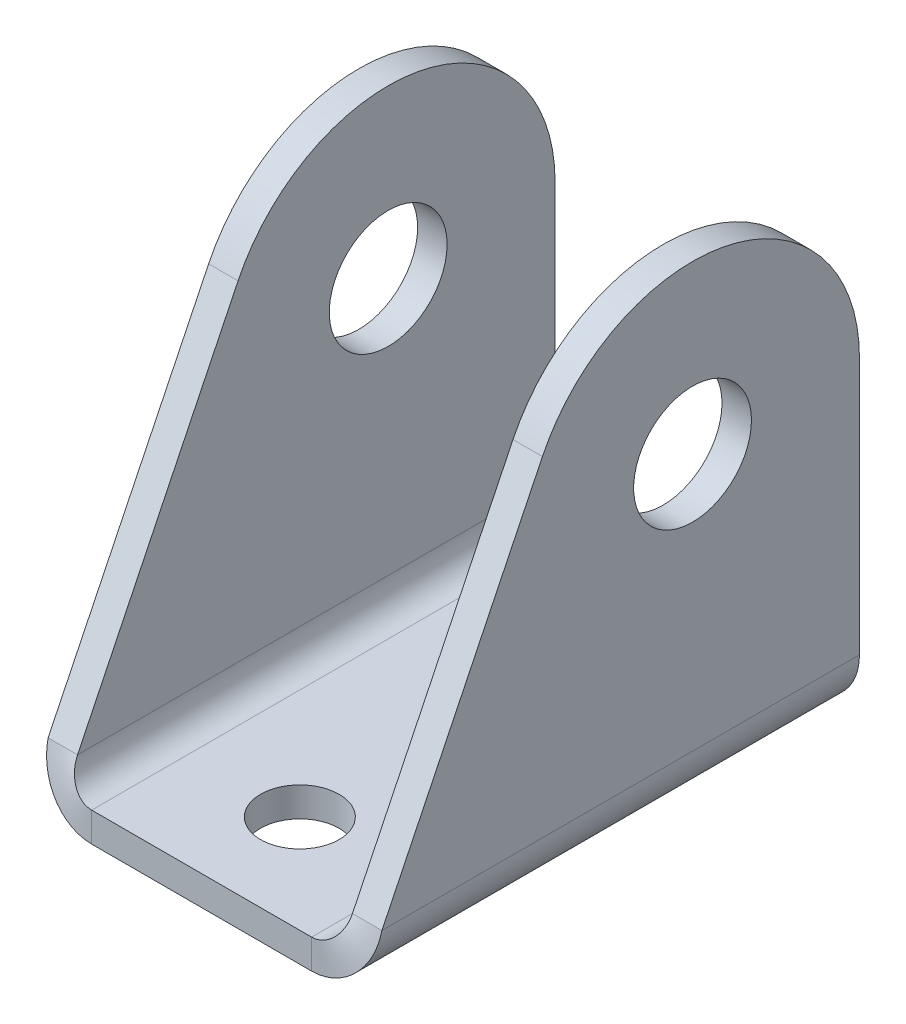
ISO-10303-21;
HEADER;
FILE_DESCRIPTION(('STEP AP214'),'2;1');
FILE_NAME('part.step','',(''),(''),'','','');
FILE_SCHEMA(('AUTOMOTIVE_DESIGN { 1 0 10303 214 1 1 1 1 }'));
ENDSEC;
DATA;
#1=APPLICATION_CONTEXT('core data for automotive mechanical design processes');
#2=APPLICATION_PROTOCOL_DEFINITION('international standard','automotive_design',2000,#1);
#3=PRODUCT_CONTEXT('',#1,'mechanical');
#4=PRODUCT('Part','Part','',(#3));
#5=PRODUCT_RELATED_PRODUCT_CATEGORY('part','',(#4));
#6=PRODUCT_DEFINITION_FORMATION('','',#4);
#7=PRODUCT_DEFINITION_CONTEXT('part definition',#1,'design');
#8=PRODUCT_DEFINITION('design','',#6,#7);
#9=PRODUCT_DEFINITION_SHAPE('','',#8);
#10=(LENGTH_UNIT() NAMED_UNIT(*) SI_UNIT(.MILLI.,.METRE.));
#11=(NAMED_UNIT(*) PLANE_ANGLE_UNIT() SI_UNIT($,.RADIAN.));
#12=(NAMED_UNIT(*) SI_UNIT($,.STERADIAN.) SOLID_ANGLE_UNIT());
#13=UNCERTAINTY_MEASURE_WITH_UNIT(LENGTH_MEASURE(1.E-05),#10,'distance_accuracy_value','');
#14=(GEOMETRIC_REPRESENTATION_CONTEXT(3) GLOBAL_UNCERTAINTY_ASSIGNED_CONTEXT((#13)) GLOBAL_UNIT_ASSIGNED_CONTEXT((#10,
#11,#12)) REPRESENTATION_CONTEXT('',''));
#15=CARTESIAN_POINT('',(0.,0.,0.));
#16=DIRECTION('',(0.,0.,1.));
#17=DIRECTION('',(1.,0.,0.));
#18=AXIS2_PLACEMENT_3D('',#15,#16,#17);
#19=CARTESIAN_POINT('',(17.,3.,-25.));
#20=DIRECTION('',(0.,0.,1.));
#21=DIRECTION('',(-1.,0.,0.));
#22=AXIS2_PLACEMENT_3D('',#19,#20,#21);
#23=PLANE('',#22);
#24=DIRECTION('',(0.,1.,0.));
#25=VECTOR('',#24,1.);
#26=CARTESIAN_POINT('',(11.2,3.,-25.));
#27=LINE('',#26,#25);
#28=CARTESIAN_POINT('',(11.2,0.,-25.));
#29=VERTEX_POINT('',#28);
#30=CARTESIAN_POINT('',(11.2,3.,-25.));
#31=VERTEX_POINT('',#30);
#32=EDGE_CURVE('E11',#29,#31,#27,.T.);
#33=ORIENTED_EDGE('',*,*,#32,.F.);
#34=DIRECTION('',(1.,0.,0.));
#35=VECTOR('',#34,1.);
#36=CARTESIAN_POINT('',(0.,0.,-25.));
#37=LINE('',#36,#35);
#38=CARTESIAN_POINT('',(-11.2,0.,-25.));
#39=VERTEX_POINT('',#38);
#40=EDGE_CURVE('E96',#29,#39,#37,.F.);
#41=ORIENTED_EDGE('',*,*,#40,.T.);
#42=DIRECTION('',(0.,1.,0.));
#43=VECTOR('',#42,1.);
#44=CARTESIAN_POINT('',(-11.2,3.,-25.));
#45=LINE('',#44,#43);
#46=CARTESIAN_POINT('',(-11.2,3.,-25.));
#47=VERTEX_POINT('',#46);
#48=EDGE_CURVE('E49',#39,#47,#45,.T.);
#49=ORIENTED_EDGE('',*,*,#48,.T.);
#50=DIRECTION('',(-1.,0.,0.));
#51=VECTOR('',#50,1.);
#52=CARTESIAN_POINT('',(17.,3.,-25.));
#53=LINE('',#52,#51);
#54=EDGE_CURVE('E98',#31,#47,#53,.T.);
#55=ORIENTED_EDGE('',*,*,#54,.F.);
#56=EDGE_LOOP('',(#33,#41,#49,#55));
#57=FACE_BOUND('',#56,.T.);
#58=ADVANCED_FACE('F39',(#57),#23,.F.);
#59=CARTESIAN_POINT('',(-11.2,5.8,-25.));
#60=DIRECTION('',(0.,0.,-1.));
#61=DIRECTION('',(-1.,0.,0.));
#62=AXIS2_PLACEMENT_3D('',#59,#60,#61);
#63=PLANE('',#62);
#64=ORIENTED_EDGE('',*,*,#48,.F.);
#65=CARTESIAN_POINT('',(-11.2,5.8,-25.));
#66=DIRECTION('',(0.,0.,1.));
#67=DIRECTION('',(1.,0.,0.));
#68=AXIS2_PLACEMENT_3D('',#65,#66,#67);
#69=CIRCLE('',#68,5.8);
#70=CARTESIAN_POINT('',(-17.,5.8,-25.));
#71=VERTEX_POINT('',#70);
#72=EDGE_CURVE('E182',#39,#71,#69,.F.);
#73=ORIENTED_EDGE('',*,*,#72,.T.);
#74=DIRECTION('',(1.,0.,0.));
#75=VECTOR('',#74,1.);
#76=CARTESIAN_POINT('',(-14.,5.8,-25.));
#77=LINE('',#76,#75);
#78=CARTESIAN_POINT('',(-14.,5.8,-25.));
#79=VERTEX_POINT('',#78);
#80=EDGE_CURVE('E172',#71,#79,#77,.T.);
#81=ORIENTED_EDGE('',*,*,#80,.T.);
#82=CARTESIAN_POINT('',(-11.2,5.8,-25.));
#83=DIRECTION('',(0.,0.,1.));
#84=DIRECTION('',(1.,0.,0.));
#85=AXIS2_PLACEMENT_3D('',#82,#83,#84);
#86=CIRCLE('',#85,2.8);
#87=EDGE_CURVE('E180',#47,#79,#86,.F.);
#88=ORIENTED_EDGE('',*,*,#87,.F.);
#89=EDGE_LOOP('',(#64,#73,#81,#88));
#90=FACE_BOUND('',#89,.T.);
#91=ADVANCED_FACE('F179',(#90),#63,.T.);
#92=CARTESIAN_POINT('',(-14.,32.,-25.));
#93=DIRECTION('',(0.,0.,1.));
#94=DIRECTION('',(0.,1.,0.));
#95=AXIS2_PLACEMENT_3D('',#92,#93,#94);
#96=PLANE('',#95);
#97=ORIENTED_EDGE('',*,*,#80,.F.);
#98=DIRECTION('',(0.,-1.,0.));
#99=VECTOR('',#98,1.);
#100=CARTESIAN_POINT('',(-17.,32.,-25.));
#101=LINE('',#100,#99);
#102=CARTESIAN_POINT('',(-17.,32.,-25.));
#103=VERTEX_POINT('',#102);
#104=EDGE_CURVE('E241',#71,#103,#101,.F.);
#105=ORIENTED_EDGE('',*,*,#104,.T.);
#106=DIRECTION('',(1.,0.,0.));
#107=VECTOR('',#106,1.);
#108=CARTESIAN_POINT('',(-14.,32.,-25.));
#109=LINE('',#108,#107);
#110=CARTESIAN_POINT('',(-14.,32.,-25.));
#111=VERTEX_POINT('',#110);
#112=EDGE_CURVE('E169',#103,#111,#109,.T.);
#113=ORIENTED_EDGE('',*,*,#112,.T.);
#114=DIRECTION('',(0.,1.,0.));
#115=VECTOR('',#114,1.);
#116=CARTESIAN_POINT('',(-14.,32.,-25.));
#117=LINE('',#116,#115);
#118=EDGE_CURVE('E199',#79,#111,#117,.T.);
#119=ORIENTED_EDGE('',*,*,#118,.F.);
#120=EDGE_LOOP('',(#97,#105,#113,#119));
#121=FACE_BOUND('',#120,.T.);
#122=ADVANCED_FACE('F200',(#121),#96,.F.);
#123=CARTESIAN_POINT('',(-14.,32.,-8.));
#124=DIRECTION('',(-1.,0.,0.));
#125=DIRECTION('',(0.,0.,1.));
#126=AXIS2_PLACEMENT_3D('',#123,#124,#125);
#127=CYLINDRICAL_SURFACE('',#126,17.);
#128=ORIENTED_EDGE('',*,*,#112,.F.);
#129=CARTESIAN_POINT('',(-17.,32.,-8.));
#130=DIRECTION('',(1.,0.,0.));
#131=DIRECTION('',(0.,0.,-1.));
#132=AXIS2_PLACEMENT_3D('',#129,#130,#131);
#133=CIRCLE('',#132,17.);
#134=CARTESIAN_POINT('',(-17.,39.4324838605148,7.28915248348275));
#135=VERTEX_POINT('',#134);
#136=EDGE_CURVE('E146',#103,#135,#133,.T.);
#137=ORIENTED_EDGE('',*,*,#136,.T.);
#138=DIRECTION('',(1.,0.,0.));
#139=VECTOR('',#138,1.);
#140=CARTESIAN_POINT('',(-14.,39.4324838605148,7.28915248348275));
#141=LINE('',#140,#139);
#142=CARTESIAN_POINT('',(-14.,39.4324838605148,7.28915248348275));
#143=VERTEX_POINT('',#142);
#144=EDGE_CURVE('E166',#135,#143,#141,.T.);
#145=ORIENTED_EDGE('',*,*,#144,.T.);
#146=CARTESIAN_POINT('',(-14.,32.,-8.));
#147=DIRECTION('',(1.,0.,0.));
#148=DIRECTION('',(0.,0.,-1.));
#149=AXIS2_PLACEMENT_3D('',#146,#147,#148);
#150=CIRCLE('',#149,17.);
#151=EDGE_CURVE('E204',#111,#143,#150,.T.);
#152=ORIENTED_EDGE('',*,*,#151,.F.);
#153=EDGE_LOOP('',(#128,#137,#145,#152));
#154=FACE_BOUND('',#153,.T.);
#155=ADVANCED_FACE('F252',(#154),#127,.T.);
#156=CARTESIAN_POINT('',(-14.,3.,25.));
#157=DIRECTION('',(0.,-0.437204932971461,-0.899361910793102));
#158=DIRECTION('',(0.,-0.899361910793102,0.437204932971461));
#159=AXIS2_PLACEMENT_3D('',#156,#157,#158);
#160=PLANE('',#159);
#161=ORIENTED_EDGE('',*,*,#144,.F.);
#162=DIRECTION('',(0.,-0.899361910793102,0.437204932971461));
#163=VECTOR('',#162,1.);
#164=CARTESIAN_POINT('',(-17.,3.,25.));
#165=LINE('',#164,#163);
#166=CARTESIAN_POINT('',(-17.,5.8,23.6388418303811));
#167=VERTEX_POINT('',#166);
#168=EDGE_CURVE('E136',#135,#167,#165,.T.);
#169=ORIENTED_EDGE('',*,*,#168,.T.);
#170=DIRECTION('',(1.,0.,0.));
#171=VECTOR('',#170,1.);
#172=CARTESIAN_POINT('',(-14.,5.8,23.6388418303811));
#173=LINE('',#172,#171);
#174=CARTESIAN_POINT('',(-14.,5.8,23.6388418303811));
#175=VERTEX_POINT('',#174);
#176=EDGE_CURVE('E163',#167,#175,#173,.T.);
#177=ORIENTED_EDGE('',*,*,#176,.T.);
#178=DIRECTION('',(0.,-0.899361910793102,0.437204932971461));
#179=VECTOR('',#178,1.);
#180=CARTESIAN_POINT('',(-14.,3.,25.));
#181=LINE('',#180,#179);
#182=EDGE_CURVE('E205',#143,#175,#181,.T.);
#183=ORIENTED_EDGE('',*,*,#182,.F.);
#184=EDGE_LOOP('',(#161,#169,#177,#183));
#185=FACE_BOUND('',#184,.T.);
#186=ADVANCED_FACE('F385',(#185),#160,.F.);
#187=CARTESIAN_POINT('',(-11.2,0.,25.));
#188=CARTESIAN_POINT('',(-11.2,1.,25.));
#189=CARTESIAN_POINT('',(-11.2,2.,25.));
#190=CARTESIAN_POINT('',(-11.2,3.,25.));
#191=CARTESIAN_POINT('',(0.399999999999982,0.,25.));
#192=CARTESIAN_POINT('',(-1.60000000000002,0.999999999999989,25.));
#193=CARTESIAN_POINT('',(-3.60000000000001,1.99999999999999,25.));
#194=CARTESIAN_POINT('',(-5.60000000000001,2.99999999999999,25.));
#195=CARTESIAN_POINT('',(0.399999999999996,11.6,22.2776836607622));
#196=CARTESIAN_POINT('',(-1.6,10.6,22.2776836607622));
#197=CARTESIAN_POINT('',(-3.6,9.59999999999999,22.2776836607622));
#198=CARTESIAN_POINT('',(-5.6,8.59999999999999,22.2776836607622));
#199=CARTESIAN_POINT('',(-11.2,11.6,22.2776836607622));
#200=CARTESIAN_POINT('',(-11.2,10.6,22.2776836607622));
#201=CARTESIAN_POINT('',(-11.2,9.6,22.2776836607622));
#202=CARTESIAN_POINT('',(-11.2,8.6,22.2776836607622));
#203=CARTESIAN_POINT('',(-22.8,11.6,22.2776836607622));
#204=CARTESIAN_POINT('',(-20.8,10.6,22.2776836607622));
#205=CARTESIAN_POINT('',(-18.8,9.60000000000001,22.2776836607622));
#206=CARTESIAN_POINT('',(-16.8,8.6,22.2776836607622));
#207=CARTESIAN_POINT('',(-22.8,0.,25.));
#208=CARTESIAN_POINT('',(-20.8,1.00000000000001,25.));
#209=CARTESIAN_POINT('',(-18.8,2.00000000000001,25.));
#210=CARTESIAN_POINT('',(-16.8,3.00000000000001,25.));
#211=CARTESIAN_POINT('',(-11.2,0.,25.));
#212=CARTESIAN_POINT('',(-11.2,1.,25.));
#213=CARTESIAN_POINT('',(-11.2,2.,25.));
#214=CARTESIAN_POINT('',(-11.2,3.,25.));
#215=(BOUNDED_SURFACE() B_SPLINE_SURFACE(3,3,((#187,#188,#189,#190),(#191,#192,#193,#194),(#195,
#196,#197,#198),(#199,#200,#201,#202),(#203,#204,#205,#206),(#207,#208,#209,#210),(#211,#212,
#213,#214)),.UNSPECIFIED.,.T.,.F.,.F.) B_SPLINE_SURFACE_WITH_KNOTS((4,3,4),(4,4),(0.,0.5,1.),
(0.,1.),.UNSPECIFIED.) GEOMETRIC_REPRESENTATION_ITEM() RATIONAL_B_SPLINE_SURFACE(((1.,1.,1.,1.),
(0.333333333333333,0.333333333333333,0.333333333333333,0.333333333333333),(0.333333333333333,
0.333333333333333,0.333333333333333,0.333333333333333),(1.,1.,1.,1.),(0.333333333333333,
0.333333333333333,0.333333333333333,0.333333333333333),(0.333333333333333,0.333333333333333,
0.333333333333333,0.333333333333333),(1.,1.,1.,1.))) REPRESENTATION_ITEM('') SURFACE());
#216=CARTESIAN_POINT('',(-11.2,5.8,23.6388418303811));
#217=DIRECTION('',(0.,-0.22847503868709,-0.973549771042515));
#218=DIRECTION('',(0.,-0.973549771042515,0.22847503868709));
#219=AXIS2_PLACEMENT_3D('',#216,#217,#218);
#220=ELLIPSE('',#219,5.95757933750951,5.8);
#221=CARTESIAN_POINT('',(-11.2,0.,25.));
#222=VERTEX_POINT('',#221);
#223=EDGE_CURVE('E138',#167,#222,#220,.F.);
#224=DIRECTION('',(0.,1.,0.));
#225=VECTOR('',#224,1.);
#226=CARTESIAN_POINT('',(-11.2,3.,25.));
#227=LINE('',#226,#225);
#228=CARTESIAN_POINT('',(-11.2,3.,25.));
#229=VERTEX_POINT('',#228);
#230=EDGE_CURVE('E161',#222,#229,#227,.T.);
#231=CARTESIAN_POINT('',(-11.2,5.8,23.6388418303811));
#232=DIRECTION('',(0.,-0.437204932971461,-0.899361910793102));
#233=DIRECTION('',(0.,-0.899361910793102,0.437204932971461));
#234=AXIS2_PLACEMENT_3D('',#231,#232,#233);
#235=ELLIPSE('',#234,3.11331841653247,2.8);
#236=EDGE_CURVE('E196',#175,#229,#235,.F.);
#237=ORIENTED_EDGE('',*,*,#176,.F.);
#238=ORIENTED_EDGE('',*,*,#223,.T.);
#239=ORIENTED_EDGE('',*,*,#230,.T.);
#240=ORIENTED_EDGE('',*,*,#236,.F.);
#241=EDGE_LOOP('',(#237,#238,#239,#240));
#242=FACE_BOUND('',#241,.T.);
#243=ADVANCED_FACE('F379',(#242),#215,.T.);
#244=CARTESIAN_POINT('',(17.,3.,25.));
#245=DIRECTION('',(0.,0.,-1.));
#246=DIRECTION('',(1.,0.,0.));
#247=AXIS2_PLACEMENT_3D('',#244,#245,#246);
#248=PLANE('',#247);
#249=ORIENTED_EDGE('',*,*,#230,.F.);
#250=DIRECTION('',(1.,0.,0.));
#251=VECTOR('',#250,1.);
#252=CARTESIAN_POINT('',(0.,0.,25.));
#253=LINE('',#252,#251);
#254=CARTESIAN_POINT('',(11.2,0.,25.));
#255=VERTEX_POINT('',#254);
#256=EDGE_CURVE('E127',#222,#255,#253,.T.);
#257=ORIENTED_EDGE('',*,*,#256,.T.);
#258=DIRECTION('',(0.,1.,0.));
#259=VECTOR('',#258,1.);
#260=CARTESIAN_POINT('',(11.2,3.,25.));
#261=LINE('',#260,#259);
#262=CARTESIAN_POINT('',(11.2,3.,25.));
#263=VERTEX_POINT('',#262);
#264=EDGE_CURVE('E158',#255,#263,#261,.T.);
#265=ORIENTED_EDGE('',*,*,#264,.T.);
#266=DIRECTION('',(1.,0.,0.));
#267=VECTOR('',#266,1.);
#268=CARTESIAN_POINT('',(17.,3.,25.));
#269=LINE('',#268,#267);
#270=EDGE_CURVE('E264',#229,#263,#269,.T.);
#271=ORIENTED_EDGE('',*,*,#270,.F.);
#272=EDGE_LOOP('',(#249,#257,#265,#271));
#273=FACE_BOUND('',#272,.T.);
#274=ADVANCED_FACE('F370',(#273),#248,.F.);
#275=CARTESIAN_POINT('',(11.2,8.6,22.2776836607622));
#276=CARTESIAN_POINT('',(11.2,9.6,22.2776836607622));
#277=CARTESIAN_POINT('',(11.2,10.6,22.2776836607622));
#278=CARTESIAN_POINT('',(11.2,11.6,22.2776836607622));
#279=CARTESIAN_POINT('',(5.60000000000001,8.6,22.2776836607622));
#280=CARTESIAN_POINT('',(3.60000000000001,9.6,22.2776836607622));
#281=CARTESIAN_POINT('',(1.60000000000001,10.6,22.2776836607622));
#282=CARTESIAN_POINT('',(-0.399999999999989,11.6,22.2776836607622));
#283=CARTESIAN_POINT('',(5.60000000000001,3.,25.));
#284=CARTESIAN_POINT('',(3.60000000000001,2.,25.));
#285=CARTESIAN_POINT('',(1.60000000000001,1.,25.));
#286=CARTESIAN_POINT('',(-0.399999999999989,0.,25.));
#287=CARTESIAN_POINT('',(11.2,3.,25.));
#288=CARTESIAN_POINT('',(11.2,2.,25.));
#289=CARTESIAN_POINT('',(11.2,1.,25.));
#290=CARTESIAN_POINT('',(11.2,0.,25.));
#291=CARTESIAN_POINT('',(16.8,3.,25.));
#292=CARTESIAN_POINT('',(18.8,2.,25.));
#293=CARTESIAN_POINT('',(20.8,0.999999999999999,25.));
#294=CARTESIAN_POINT('',(22.8,0.,25.));
#295=CARTESIAN_POINT('',(16.8,8.6,22.2776836607622));
#296=CARTESIAN_POINT('',(18.8,9.6,22.2776836607622));
#297=CARTESIAN_POINT('',(20.8,10.6,22.2776836607622));
#298=CARTESIAN_POINT('',(22.8,11.6,22.2776836607622));
#299=CARTESIAN_POINT('',(11.2,8.6,22.2776836607622));
#300=CARTESIAN_POINT('',(11.2,9.6,22.2776836607622));
#301=CARTESIAN_POINT('',(11.2,10.6,22.2776836607622));
#302=CARTESIAN_POINT('',(11.2,11.6,22.2776836607622));
#303=(BOUNDED_SURFACE() B_SPLINE_SURFACE(3,3,((#275,#276,#277,#278),(#279,#280,#281,#282),(#283,
#284,#285,#286),(#287,#288,#289,#290),(#291,#292,#293,#294),(#295,#296,#297,#298),(#299,#300,
#301,#302)),.UNSPECIFIED.,.T.,.F.,.F.) B_SPLINE_SURFACE_WITH_KNOTS((4,3,4),(4,4),(0.,0.5,1.),
(0.,1.),.UNSPECIFIED.) GEOMETRIC_REPRESENTATION_ITEM() RATIONAL_B_SPLINE_SURFACE(((1.,1.,1.,1.),
(0.333333333333333,0.333333333333333,0.333333333333333,0.333333333333333),(0.333333333333333,
0.333333333333333,0.333333333333333,0.333333333333333),(1.,1.,1.,1.),(0.333333333333333,
0.333333333333333,0.333333333333333,0.333333333333333),(0.333333333333333,0.333333333333333,
0.333333333333333,0.333333333333333),(1.,1.,1.,1.))) REPRESENTATION_ITEM('') SURFACE());
#304=CARTESIAN_POINT('',(11.2,5.8,23.6388418303811));
#305=DIRECTION('',(0.,0.22847503868709,0.973549771042515));
#306=DIRECTION('',(0.,0.973549771042515,-0.22847503868709));
#307=AXIS2_PLACEMENT_3D('',#304,#305,#306);
#308=ELLIPSE('',#307,5.95757933750951,5.8);
#309=CARTESIAN_POINT('',(17.,5.8,23.6388418303811));
#310=VERTEX_POINT('',#309);
#311=EDGE_CURVE('E114',#255,#310,#308,.T.);
#312=DIRECTION('',(-1.,0.,0.));
#313=VECTOR('',#312,1.);
#314=CARTESIAN_POINT('',(14.,5.8,23.6388418303811));
#315=LINE('',#314,#313);
#316=CARTESIAN_POINT('',(14.,5.8,23.6388418303811));
#317=VERTEX_POINT('',#316);
#318=EDGE_CURVE('E155',#310,#317,#315,.T.);
#319=CARTESIAN_POINT('',(11.2,5.8,23.6388418303811));
#320=DIRECTION('',(0.,0.437204932971461,0.899361910793102));
#321=DIRECTION('',(0.,0.899361910793102,-0.437204932971461));
#322=AXIS2_PLACEMENT_3D('',#319,#320,#321);
#323=ELLIPSE('',#322,3.11331841653247,2.8);
#324=EDGE_CURVE('E221',#263,#317,#323,.T.);
#325=ORIENTED_EDGE('',*,*,#264,.F.);
#326=ORIENTED_EDGE('',*,*,#311,.T.);
#327=ORIENTED_EDGE('',*,*,#318,.T.);
#328=ORIENTED_EDGE('',*,*,#324,.F.);
#329=EDGE_LOOP('',(#325,#326,#327,#328));
#330=FACE_BOUND('',#329,.T.);
#331=ADVANCED_FACE('F364',(#330),#303,.F.);
#332=CARTESIAN_POINT('',(14.,3.,25.));
#333=DIRECTION('',(0.,0.437204932971461,0.899361910793102));
#334=DIRECTION('',(0.,-0.899361910793102,0.437204932971461));
#335=AXIS2_PLACEMENT_3D('',#332,#333,#334);
#336=PLANE('',#335);
#337=ORIENTED_EDGE('',*,*,#318,.F.);
#338=DIRECTION('',(0.,-0.899361910793102,0.437204932971461));
#339=VECTOR('',#338,1.);
#340=CARTESIAN_POINT('',(17.,3.,25.));
#341=LINE('',#340,#339);
#342=CARTESIAN_POINT('',(17.,39.4324838605148,7.28915248348275));
#343=VERTEX_POINT('',#342);
#344=EDGE_CURVE('E231',#343,#310,#341,.T.);
#345=ORIENTED_EDGE('',*,*,#344,.F.);
#346=DIRECTION('',(-1.,0.,0.));
#347=VECTOR('',#346,1.);
#348=CARTESIAN_POINT('',(14.,39.4324838605148,7.28915248348275));
#349=LINE('',#348,#347);
#350=CARTESIAN_POINT('',(14.,39.4324838605148,7.28915248348275));
#351=VERTEX_POINT('',#350);
#352=EDGE_CURVE('E152',#343,#351,#349,.T.);
#353=ORIENTED_EDGE('',*,*,#352,.T.);
#354=DIRECTION('',(0.,-0.899361910793102,0.437204932971461));
#355=VECTOR('',#354,1.);
#356=CARTESIAN_POINT('',(14.,3.,25.));
#357=LINE('',#356,#355);
#358=EDGE_CURVE('E274',#351,#317,#357,.T.);
#359=ORIENTED_EDGE('',*,*,#358,.T.);
#360=EDGE_LOOP('',(#337,#345,#353,#359));
#361=FACE_BOUND('',#360,.T.);
#362=ADVANCED_FACE('F360',(#361),#336,.T.);
#363=CARTESIAN_POINT('',(14.,32.,-8.));
#364=DIRECTION('',(1.,0.,0.));
#365=DIRECTION('',(0.,0.,-1.));
#366=AXIS2_PLACEMENT_3D('',#363,#364,#365);
#367=CYLINDRICAL_SURFACE('',#366,17.);
#368=ORIENTED_EDGE('',*,*,#352,.F.);
#369=CARTESIAN_POINT('',(17.,32.,-8.));
#370=DIRECTION('',(1.,0.,0.));
#371=DIRECTION('',(0.,0.,-1.));
#372=AXIS2_PLACEMENT_3D('',#369,#370,#371);
#373=CIRCLE('',#372,17.);
#374=CARTESIAN_POINT('',(17.,32.,-25.));
#375=VERTEX_POINT('',#374);
#376=EDGE_CURVE('E222',#375,#343,#373,.T.);
#377=ORIENTED_EDGE('',*,*,#376,.F.);
#378=DIRECTION('',(-1.,0.,0.));
#379=VECTOR('',#378,1.);
#380=CARTESIAN_POINT('',(14.,32.,-25.));
#381=LINE('',#380,#379);
#382=CARTESIAN_POINT('',(14.,32.,-25.));
#383=VERTEX_POINT('',#382);
#384=EDGE_CURVE('E149',#375,#383,#381,.T.);
#385=ORIENTED_EDGE('',*,*,#384,.T.);
#386=CARTESIAN_POINT('',(14.,32.,-8.));
#387=DIRECTION('',(1.,0.,0.));
#388=DIRECTION('',(0.,0.,-1.));
#389=AXIS2_PLACEMENT_3D('',#386,#387,#388);
#390=CIRCLE('',#389,17.);
#391=EDGE_CURVE('E277',#383,#351,#390,.T.);
#392=ORIENTED_EDGE('',*,*,#391,.T.);
#393=EDGE_LOOP('',(#368,#377,#385,#392));
#394=FACE_BOUND('',#393,.T.);
#395=ADVANCED_FACE('F356',(#394),#367,.T.);
#396=CARTESIAN_POINT('',(14.,32.,-25.));
#397=DIRECTION('',(0.,0.,-1.));
#398=DIRECTION('',(0.,1.,0.));
#399=AXIS2_PLACEMENT_3D('',#396,#397,#398);
#400=PLANE('',#399);
#401=ORIENTED_EDGE('',*,*,#384,.F.);
#402=DIRECTION('',(0.,1.,0.));
#403=VECTOR('',#402,1.);
#404=CARTESIAN_POINT('',(17.,32.,-25.));
#405=LINE('',#404,#403);
#406=CARTESIAN_POINT('',(17.,5.8,-25.));
#407=VERTEX_POINT('',#406);
#408=EDGE_CURVE('E228',#407,#375,#405,.T.);
#409=ORIENTED_EDGE('',*,*,#408,.F.);
#410=DIRECTION('',(-1.,0.,0.));
#411=VECTOR('',#410,1.);
#412=CARTESIAN_POINT('',(14.,5.8,-25.));
#413=LINE('',#412,#411);
#414=CARTESIAN_POINT('',(14.,5.8,-25.));
#415=VERTEX_POINT('',#414);
#416=EDGE_CURVE('E43',#407,#415,#413,.T.);
#417=ORIENTED_EDGE('',*,*,#416,.T.);
#418=DIRECTION('',(0.,1.,0.));
#419=VECTOR('',#418,1.);
#420=CARTESIAN_POINT('',(14.,32.,-25.));
#421=LINE('',#420,#419);
#422=EDGE_CURVE('E271',#415,#383,#421,.T.);
#423=ORIENTED_EDGE('',*,*,#422,.T.);
#424=EDGE_LOOP('',(#401,#409,#417,#423));
#425=FACE_BOUND('',#424,.T.);
#426=ADVANCED_FACE('F353',(#425),#400,.T.);
#427=CARTESIAN_POINT('',(-14.,32.,-8.));
#428=DIRECTION('',(-1.,0.,0.));
#429=DIRECTION('',(0.,0.,1.));
#430=AXIS2_PLACEMENT_3D('',#427,#428,#429);
#431=CYLINDRICAL_SURFACE('',#430,6.);
#432=CARTESIAN_POINT('',(-14.,32.,-8.));
#433=DIRECTION('',(1.,0.,0.));
#434=DIRECTION('',(0.,0.,-1.));
#435=AXIS2_PLACEMENT_3D('',#432,#433,#434);
#436=CIRCLE('',#435,6.);
#437=CARTESIAN_POINT('',(-14.,32.,-14.));
#438=VERTEX_POINT('',#437);
#439=EDGE_CURVE('E287',#438,#438,#436,.T.);
#440=ORIENTED_EDGE('',*,*,#439,.T.);
#441=EDGE_LOOP('',(#440));
#442=FACE_BOUND('',#441,.T.);
#443=CARTESIAN_POINT('',(-17.,32.,-8.));
#444=DIRECTION('',(1.,0.,0.));
#445=DIRECTION('',(0.,0.,-1.));
#446=AXIS2_PLACEMENT_3D('',#443,#444,#445);
#447=CIRCLE('',#446,6.);
#448=CARTESIAN_POINT('',(-17.,32.,-14.));
#449=VERTEX_POINT('',#448);
#450=EDGE_CURVE('E133',#449,#449,#447,.T.);
#451=ORIENTED_EDGE('',*,*,#450,.F.);
#452=EDGE_LOOP('',(#451));
#453=FACE_BOUND('',#452,.T.);
#454=ADVANCED_FACE('F41',(#442,#453),#431,.F.);
#455=CARTESIAN_POINT('',(0.,3.,15.));
#456=DIRECTION('',(0.,-1.,0.));
#457=DIRECTION('',(0.,0.,-1.));
#458=AXIS2_PLACEMENT_3D('',#455,#456,#457);
#459=CYLINDRICAL_SURFACE('',#458,4.);
#460=CARTESIAN_POINT('',(0.,3.,15.));
#461=DIRECTION('',(0.,-1.,0.));
#462=DIRECTION('',(0.,0.,-1.));
#463=AXIS2_PLACEMENT_3D('',#460,#461,#462);
#464=CIRCLE('',#463,4.);
#465=CARTESIAN_POINT('',(0.,3.,11.));
#466=VERTEX_POINT('',#465);
#467=EDGE_CURVE('E255',#466,#466,#464,.T.);
#468=ORIENTED_EDGE('',*,*,#467,.F.);
#469=EDGE_LOOP('',(#468));
#470=FACE_BOUND('',#469,.T.);
#471=CARTESIAN_POINT('',(0.,0.,15.));
#472=DIRECTION('',(0.,-1.,0.));
#473=DIRECTION('',(0.,0.,-1.));
#474=AXIS2_PLACEMENT_3D('',#471,#472,#473);
#475=CIRCLE('',#474,4.);
#476=CARTESIAN_POINT('',(0.,0.,11.));
#477=VERTEX_POINT('',#476);
#478=EDGE_CURVE('E142',#477,#477,#475,.T.);
#479=ORIENTED_EDGE('',*,*,#478,.T.);
#480=EDGE_LOOP('',(#479));
#481=FACE_BOUND('',#480,.T.);
#482=ADVANCED_FACE('F317',(#470,#481),#459,.F.);
#483=CARTESIAN_POINT('',(0.,3.,-15.));
#484=DIRECTION('',(0.,-1.,0.));
#485=DIRECTION('',(0.,0.,-1.));
#486=AXIS2_PLACEMENT_3D('',#483,#484,#485);
#487=CYLINDRICAL_SURFACE('',#486,4.);
#488=CARTESIAN_POINT('',(0.,3.,-15.));
#489=DIRECTION('',(0.,1.,0.));
#490=DIRECTION('',(0.,0.,1.));
#491=AXIS2_PLACEMENT_3D('',#488,#489,#490);
#492=CIRCLE('',#491,4.);
#493=CARTESIAN_POINT('',(0.,3.,-11.));
#494=VERTEX_POINT('',#493);
#495=EDGE_CURVE('E258',#494,#494,#492,.T.);
#496=ORIENTED_EDGE('',*,*,#495,.T.);
#497=EDGE_LOOP('',(#496));
#498=FACE_BOUND('',#497,.T.);
#499=CARTESIAN_POINT('',(0.,0.,-15.));
#500=DIRECTION('',(0.,1.,0.));
#501=DIRECTION('',(0.,0.,1.));
#502=AXIS2_PLACEMENT_3D('',#499,#500,#501);
#503=CIRCLE('',#502,4.);
#504=CARTESIAN_POINT('',(0.,0.,-11.));
#505=VERTEX_POINT('',#504);
#506=EDGE_CURVE('E145',#505,#505,#503,.T.);
#507=ORIENTED_EDGE('',*,*,#506,.F.);
#508=EDGE_LOOP('',(#507));
#509=FACE_BOUND('',#508,.T.);
#510=ADVANCED_FACE('F319',(#498,#509),#487,.F.);
#511=CARTESIAN_POINT('',(14.,32.,-8.));
#512=DIRECTION('',(1.,0.,0.));
#513=DIRECTION('',(0.,0.,-1.));
#514=AXIS2_PLACEMENT_3D('',#511,#512,#513);
#515=CYLINDRICAL_SURFACE('',#514,6.);
#516=CARTESIAN_POINT('',(14.,32.,-8.));
#517=DIRECTION('',(1.,0.,0.));
#518=DIRECTION('',(0.,0.,-1.));
#519=AXIS2_PLACEMENT_3D('',#516,#517,#518);
#520=CIRCLE('',#519,6.);
#521=CARTESIAN_POINT('',(14.,32.,-14.));
#522=VERTEX_POINT('',#521);
#523=EDGE_CURVE('E268',#522,#522,#520,.T.);
#524=ORIENTED_EDGE('',*,*,#523,.F.);
#525=EDGE_LOOP('',(#524));
#526=FACE_BOUND('',#525,.T.);
#527=CARTESIAN_POINT('',(17.,32.,-8.));
#528=DIRECTION('',(1.,0.,0.));
#529=DIRECTION('',(0.,0.,-1.));
#530=AXIS2_PLACEMENT_3D('',#527,#528,#529);
#531=CIRCLE('',#530,6.);
#532=CARTESIAN_POINT('',(17.,32.,-14.));
#533=VERTEX_POINT('',#532);
#534=EDGE_CURVE('E126',#533,#533,#531,.T.);
#535=ORIENTED_EDGE('',*,*,#534,.T.);
#536=EDGE_LOOP('',(#535));
#537=FACE_BOUND('',#536,.T.);
#538=ADVANCED_FACE('F316',(#526,#537),#515,.F.);
#539=CARTESIAN_POINT('',(11.2,5.8,-25.));
#540=DIRECTION('',(0.,0.,1.));
#541=DIRECTION('',(1.,0.,0.));
#542=AXIS2_PLACEMENT_3D('',#539,#540,#541);
#543=PLANE('',#542);
#544=CARTESIAN_POINT('',(11.2,5.8,-25.));
#545=DIRECTION('',(0.,0.,-1.));
#546=DIRECTION('',(-1.,0.,0.));
#547=AXIS2_PLACEMENT_3D('',#544,#545,#546);
#548=CIRCLE('',#547,5.8);
#549=EDGE_CURVE('E111',#407,#29,#548,.T.);
#550=ORIENTED_EDGE('',*,*,#549,.T.);
#551=ORIENTED_EDGE('',*,*,#32,.T.);
#552=CARTESIAN_POINT('',(11.2,5.8,-25.));
#553=DIRECTION('',(0.,0.,-1.));
#554=DIRECTION('',(-1.,0.,0.));
#555=AXIS2_PLACEMENT_3D('',#552,#553,#554);
#556=CIRCLE('',#555,2.8);
#557=EDGE_CURVE('E217',#415,#31,#556,.T.);
#558=ORIENTED_EDGE('',*,*,#557,.F.);
#559=ORIENTED_EDGE('',*,*,#416,.F.);
#560=EDGE_LOOP('',(#550,#551,#558,#559));
#561=FACE_BOUND('',#560,.T.);
#562=ADVANCED_FACE('F130',(#561),#543,.F.);
#563=CARTESIAN_POINT('',(14.,32.,-8.));
#564=DIRECTION('',(1.,0.,0.));
#565=DIRECTION('',(0.,0.,-1.));
#566=AXIS2_PLACEMENT_3D('',#563,#564,#565);
#567=PLANE('',#566);
#568=ORIENTED_EDGE('',*,*,#523,.T.);
#569=EDGE_LOOP('',(#568));
#570=FACE_BOUND('',#569,.T.);
#571=ORIENTED_EDGE('',*,*,#422,.F.);
#572=DIRECTION('',(0.,0.,1.));
#573=VECTOR('',#572,1.);
#574=CARTESIAN_POINT('',(14.,5.8,25.));
#575=LINE('',#574,#573);
#576=EDGE_CURVE('E214',#415,#317,#575,.T.);
#577=ORIENTED_EDGE('',*,*,#576,.T.);
#578=ORIENTED_EDGE('',*,*,#358,.F.);
#579=ORIENTED_EDGE('',*,*,#391,.F.);
#580=EDGE_LOOP('',(#571,#577,#578,#579));
#581=FACE_BOUND('',#580,.T.);
#582=ADVANCED_FACE('F303',(#570,#581),#567,.F.);
#583=CARTESIAN_POINT('',(0.,3.,0.));
#584=DIRECTION('',(0.,-1.,0.));
#585=DIRECTION('',(0.,0.,-1.));
#586=AXIS2_PLACEMENT_3D('',#583,#584,#585);
#587=PLANE('',#586);
#588=ORIENTED_EDGE('',*,*,#467,.T.);
#589=EDGE_LOOP('',(#588));
#590=FACE_BOUND('',#589,.T.);
#591=ORIENTED_EDGE('',*,*,#495,.F.);
#592=EDGE_LOOP('',(#591));
#593=FACE_BOUND('',#592,.T.);
#594=ORIENTED_EDGE('',*,*,#54,.T.);
#595=DIRECTION('',(0.,0.,-1.));
#596=VECTOR('',#595,1.);
#597=CARTESIAN_POINT('',(-11.2,3.,25.));
#598=LINE('',#597,#596);
#599=EDGE_CURVE('E195',#47,#229,#598,.F.);
#600=ORIENTED_EDGE('',*,*,#599,.T.);
#601=ORIENTED_EDGE('',*,*,#270,.T.);
#602=DIRECTION('',(0.,0.,1.));
#603=VECTOR('',#602,1.);
#604=CARTESIAN_POINT('',(11.2,3.,-25.));
#605=LINE('',#604,#603);
#606=EDGE_CURVE('E211',#263,#31,#605,.F.);
#607=ORIENTED_EDGE('',*,*,#606,.T.);
#608=EDGE_LOOP('',(#594,#600,#601,#607));
#609=FACE_BOUND('',#608,.T.);
#610=ADVANCED_FACE('F296',(#590,#593,#609),#587,.F.);
#611=CARTESIAN_POINT('',(-14.,32.,-8.));
#612=DIRECTION('',(-1.,0.,0.));
#613=DIRECTION('',(0.,0.,-1.));
#614=AXIS2_PLACEMENT_3D('',#611,#612,#613);
#615=PLANE('',#614);
#616=ORIENTED_EDGE('',*,*,#439,.F.);
#617=EDGE_LOOP('',(#616));
#618=FACE_BOUND('',#617,.T.);
#619=ORIENTED_EDGE('',*,*,#182,.T.);
#620=DIRECTION('',(0.,0.,-1.));
#621=VECTOR('',#620,1.);
#622=CARTESIAN_POINT('',(-14.,5.8,-25.));
#623=LINE('',#622,#621);
#624=EDGE_CURVE('E193',#175,#79,#623,.T.);
#625=ORIENTED_EDGE('',*,*,#624,.T.);
#626=ORIENTED_EDGE('',*,*,#118,.T.);
#627=ORIENTED_EDGE('',*,*,#151,.T.);
#628=EDGE_LOOP('',(#619,#625,#626,#627));
#629=FACE_BOUND('',#628,.T.);
#630=ADVANCED_FACE('F208',(#618,#629),#615,.F.);
#631=CARTESIAN_POINT('',(11.2,5.8,-8.));
#632=DIRECTION('',(0.,0.,-1.));
#633=DIRECTION('',(-1.,0.,0.));
#634=AXIS2_PLACEMENT_3D('',#631,#632,#633);
#635=CYLINDRICAL_SURFACE('',#634,2.8);
#636=ORIENTED_EDGE('',*,*,#557,.T.);
#637=ORIENTED_EDGE('',*,*,#606,.F.);
#638=ORIENTED_EDGE('',*,*,#324,.T.);
#639=ORIENTED_EDGE('',*,*,#576,.F.);
#640=EDGE_LOOP('',(#636,#637,#638,#639));
#641=FACE_BOUND('',#640,.T.);
#642=ADVANCED_FACE('F295',(#641),#635,.F.);
#643=CARTESIAN_POINT('',(-11.2,5.8,-8.));
#644=DIRECTION('',(0.,0.,1.));
#645=DIRECTION('',(1.,0.,0.));
#646=AXIS2_PLACEMENT_3D('',#643,#644,#645);
#647=CYLINDRICAL_SURFACE('',#646,2.8);
#648=ORIENTED_EDGE('',*,*,#236,.T.);
#649=ORIENTED_EDGE('',*,*,#599,.F.);
#650=ORIENTED_EDGE('',*,*,#87,.T.);
#651=ORIENTED_EDGE('',*,*,#624,.F.);
#652=EDGE_LOOP('',(#648,#649,#650,#651));
#653=FACE_BOUND('',#652,.T.);
#654=ADVANCED_FACE('F191',(#653),#647,.F.);
#655=CARTESIAN_POINT('',(17.,32.,-8.));
#656=DIRECTION('',(1.,0.,0.));
#657=DIRECTION('',(0.,0.,-1.));
#658=AXIS2_PLACEMENT_3D('',#655,#656,#657);
#659=PLANE('',#658);
#660=ORIENTED_EDGE('',*,*,#534,.F.);
#661=EDGE_LOOP('',(#660));
#662=FACE_BOUND('',#661,.T.);
#663=ORIENTED_EDGE('',*,*,#408,.T.);
#664=ORIENTED_EDGE('',*,*,#376,.T.);
#665=ORIENTED_EDGE('',*,*,#344,.T.);
#666=DIRECTION('',(0.,0.,-1.));
#667=VECTOR('',#666,1.);
#668=CARTESIAN_POINT('',(17.,5.8,-8.));
#669=LINE('',#668,#667);
#670=EDGE_CURVE('E119',#407,#310,#669,.F.);
#671=ORIENTED_EDGE('',*,*,#670,.F.);
#672=EDGE_LOOP('',(#663,#664,#665,#671));
#673=FACE_BOUND('',#672,.T.);
#674=ADVANCED_FACE('F333',(#662,#673),#659,.T.);
#675=CARTESIAN_POINT('',(0.,0.,0.));
#676=DIRECTION('',(0.,-1.,0.));
#677=DIRECTION('',(0.,0.,-1.));
#678=AXIS2_PLACEMENT_3D('',#675,#676,#677);
#679=PLANE('',#678);
#680=ORIENTED_EDGE('',*,*,#478,.F.);
#681=EDGE_LOOP('',(#680));
#682=FACE_BOUND('',#681,.T.);
#683=ORIENTED_EDGE('',*,*,#506,.T.);
#684=EDGE_LOOP('',(#683));
#685=FACE_BOUND('',#684,.T.);
#686=ORIENTED_EDGE('',*,*,#40,.F.);
#687=DIRECTION('',(0.,0.,-1.));
#688=VECTOR('',#687,1.);
#689=CARTESIAN_POINT('',(11.2,0.,0.));
#690=LINE('',#689,#688);
#691=EDGE_CURVE('E108',#255,#29,#690,.T.);
#692=ORIENTED_EDGE('',*,*,#691,.F.);
#693=ORIENTED_EDGE('',*,*,#256,.F.);
#694=DIRECTION('',(0.,0.,-1.));
#695=VECTOR('',#694,1.);
#696=CARTESIAN_POINT('',(-11.2,0.,0.));
#697=LINE('',#696,#695);
#698=EDGE_CURVE('E124',#39,#222,#697,.F.);
#699=ORIENTED_EDGE('',*,*,#698,.F.);
#700=EDGE_LOOP('',(#686,#692,#693,#699));
#701=FACE_BOUND('',#700,.T.);
#702=ADVANCED_FACE('F122',(#682,#685,#701),#679,.T.);
#703=CARTESIAN_POINT('',(-17.,32.,-8.));
#704=DIRECTION('',(-1.,0.,0.));
#705=DIRECTION('',(0.,0.,-1.));
#706=AXIS2_PLACEMENT_3D('',#703,#704,#705);
#707=PLANE('',#706);
#708=ORIENTED_EDGE('',*,*,#450,.T.);
#709=EDGE_LOOP('',(#708));
#710=FACE_BOUND('',#709,.T.);
#711=ORIENTED_EDGE('',*,*,#168,.F.);
#712=ORIENTED_EDGE('',*,*,#136,.F.);
#713=ORIENTED_EDGE('',*,*,#104,.F.);
#714=DIRECTION('',(0.,0.,-1.));
#715=VECTOR('',#714,1.);
#716=CARTESIAN_POINT('',(-17.,5.8,-8.));
#717=LINE('',#716,#715);
#718=EDGE_CURVE('E118',#167,#71,#717,.T.);
#719=ORIENTED_EDGE('',*,*,#718,.F.);
#720=EDGE_LOOP('',(#711,#712,#713,#719));
#721=FACE_BOUND('',#720,.T.);
#722=ADVANCED_FACE('F249',(#710,#721),#707,.T.);
#723=CARTESIAN_POINT('',(11.2,5.8,-8.));
#724=DIRECTION('',(0.,0.,-1.));
#725=DIRECTION('',(-1.,0.,0.));
#726=AXIS2_PLACEMENT_3D('',#723,#724,#725);
#727=CYLINDRICAL_SURFACE('',#726,5.8);
#728=ORIENTED_EDGE('',*,*,#549,.F.);
#729=ORIENTED_EDGE('',*,*,#670,.T.);
#730=ORIENTED_EDGE('',*,*,#311,.F.);
#731=ORIENTED_EDGE('',*,*,#691,.T.);
#732=EDGE_LOOP('',(#728,#729,#730,#731));
#733=FACE_BOUND('',#732,.T.);
#734=ADVANCED_FACE('F109',(#733),#727,.T.);
#735=CARTESIAN_POINT('',(-11.2,5.8,-8.));
#736=DIRECTION('',(0.,0.,1.));
#737=DIRECTION('',(1.,0.,0.));
#738=AXIS2_PLACEMENT_3D('',#735,#736,#737);
#739=CYLINDRICAL_SURFACE('',#738,5.8);
#740=ORIENTED_EDGE('',*,*,#223,.F.);
#741=ORIENTED_EDGE('',*,*,#718,.T.);
#742=ORIENTED_EDGE('',*,*,#72,.F.);
#743=ORIENTED_EDGE('',*,*,#698,.T.);
#744=EDGE_LOOP('',(#740,#741,#742,#743));
#745=FACE_BOUND('',#744,.T.);
#746=ADVANCED_FACE('F349',(#745),#739,.T.);
#747=CLOSED_SHELL('',(#58,#91,#122,#155,#186,#243,#274,#331,#362,#395,#426,#454,#482,#510,#538,
#562,#582,#610,#630,#642,#654,#674,#702,#722,#734,#746));
#748=MANIFOLD_SOLID_BREP('B2',#747);
#749=ADVANCED_BREP_SHAPE_REPRESENTATION('',(#18,#748),#14);
#750=SHAPE_DEFINITION_REPRESENTATION(#9,#749);
ENDSEC;
END-ISO-10303-21;
